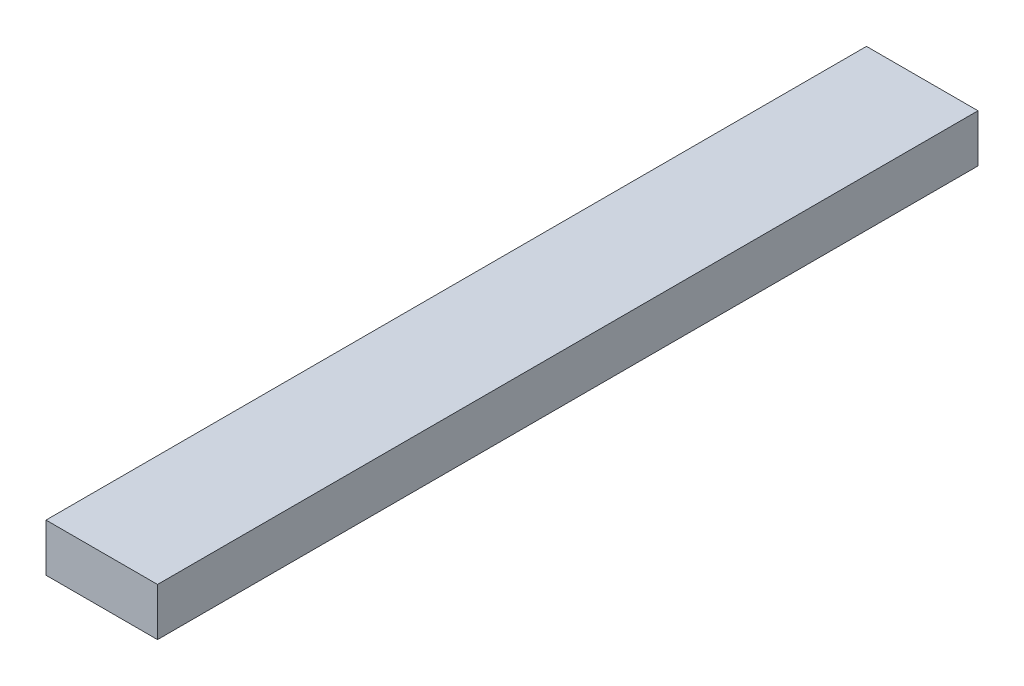
ISO-10303-21;
HEADER;
FILE_DESCRIPTION(('STEP AP214'),'2;1');
FILE_NAME('part.step','',(''),(''),'','','');
FILE_SCHEMA(('AUTOMOTIVE_DESIGN { 1 0 10303 214 1 1 1 1 }'));
ENDSEC;
DATA;
#1=APPLICATION_CONTEXT('core data for automotive mechanical design processes');
#2=APPLICATION_PROTOCOL_DEFINITION('international standard','automotive_design',2000,#1);
#3=PRODUCT_CONTEXT('',#1,'mechanical');
#4=PRODUCT('Part','Part','',(#3));
#5=PRODUCT_RELATED_PRODUCT_CATEGORY('part','',(#4));
#6=PRODUCT_DEFINITION_FORMATION('','',#4);
#7=PRODUCT_DEFINITION_CONTEXT('part definition',#1,'design');
#8=PRODUCT_DEFINITION('design','',#6,#7);
#9=PRODUCT_DEFINITION_SHAPE('','',#8);
#10=(LENGTH_UNIT() NAMED_UNIT(*) SI_UNIT(.MILLI.,.METRE.));
#11=(NAMED_UNIT(*) PLANE_ANGLE_UNIT() SI_UNIT($,.RADIAN.));
#12=(NAMED_UNIT(*) SI_UNIT($,.STERADIAN.) SOLID_ANGLE_UNIT());
#13=UNCERTAINTY_MEASURE_WITH_UNIT(LENGTH_MEASURE(1.E-05),#10,'distance_accuracy_value','');
#14=(GEOMETRIC_REPRESENTATION_CONTEXT(3) GLOBAL_UNCERTAINTY_ASSIGNED_CONTEXT((#13)) GLOBAL_UNIT_ASSIGNED_CONTEXT((#10,
#11,#12)) REPRESENTATION_CONTEXT('',''));
#15=CARTESIAN_POINT('',(0.,0.,0.));
#16=DIRECTION('',(0.,0.,1.));
#17=DIRECTION('',(1.,0.,0.));
#18=AXIS2_PLACEMENT_3D('',#15,#16,#17);
#19=CARTESIAN_POINT('',(-73.168223126647,74.6988449304645,654.05));
#20=DIRECTION('',(1.,0.,0.));
#21=DIRECTION('',(0.,0.,-1.));
#22=AXIS2_PLACEMENT_3D('',#19,#20,#21);
#23=PLANE('',#22);
#24=DIRECTION('',(0.,-1.,0.));
#25=VECTOR('',#24,1.);
#26=CARTESIAN_POINT('',(-73.168223126647,74.6988449304645,0.));
#27=LINE('',#26,#25);
#28=CARTESIAN_POINT('',(-73.168223126647,74.6988449304645,0.));
#29=VERTEX_POINT('',#28);
#30=CARTESIAN_POINT('',(-73.168223126647,36.5988449304645,0.));
#31=VERTEX_POINT('',#30);
#32=EDGE_CURVE('E95',#29,#31,#27,.T.);
#33=ORIENTED_EDGE('',*,*,#32,.T.);
#34=DIRECTION('',(0.,0.,-1.));
#35=VECTOR('',#34,1.);
#36=CARTESIAN_POINT('',(-73.168223126647,36.5988449304645,654.05));
#37=LINE('',#36,#35);
#38=CARTESIAN_POINT('',(-73.168223126647,36.5988449304645,654.05));
#39=VERTEX_POINT('',#38);
#40=EDGE_CURVE('E11',#39,#31,#37,.T.);
#41=ORIENTED_EDGE('',*,*,#40,.F.);
#42=DIRECTION('',(0.,-1.,0.));
#43=VECTOR('',#42,1.);
#44=CARTESIAN_POINT('',(-73.168223126647,74.6988449304645,654.05));
#45=LINE('',#44,#43);
#46=CARTESIAN_POINT('',(-73.168223126647,74.6988449304645,654.05));
#47=VERTEX_POINT('',#46);
#48=EDGE_CURVE('E83',#47,#39,#45,.T.);
#49=ORIENTED_EDGE('',*,*,#48,.F.);
#50=DIRECTION('',(0.,0.,-1.));
#51=VECTOR('',#50,1.);
#52=CARTESIAN_POINT('',(-73.168223126647,74.6988449304645,654.05));
#53=LINE('',#52,#51);
#54=EDGE_CURVE('E91',#47,#29,#53,.T.);
#55=ORIENTED_EDGE('',*,*,#54,.T.);
#56=EDGE_LOOP('',(#33,#41,#49,#55));
#57=FACE_BOUND('',#56,.T.);
#58=ADVANCED_FACE('F32',(#57),#23,.F.);
#59=CARTESIAN_POINT('',(-73.168223126647,36.5988449304645,654.05));
#60=DIRECTION('',(0.,1.,0.));
#61=DIRECTION('',(0.,0.,1.));
#62=AXIS2_PLACEMENT_3D('',#59,#60,#61);
#63=PLANE('',#62);
#64=DIRECTION('',(1.,0.,0.));
#65=VECTOR('',#64,1.);
#66=CARTESIAN_POINT('',(-73.168223126647,36.5988449304645,0.));
#67=LINE('',#66,#65);
#68=CARTESIAN_POINT('',(15.731776873353,36.5988449304645,0.));
#69=VERTEX_POINT('',#68);
#70=EDGE_CURVE('E87',#31,#69,#67,.T.);
#71=ORIENTED_EDGE('',*,*,#70,.T.);
#72=DIRECTION('',(0.,0.,-1.));
#73=VECTOR('',#72,1.);
#74=CARTESIAN_POINT('',(15.731776873353,36.5988449304645,654.05));
#75=LINE('',#74,#73);
#76=CARTESIAN_POINT('',(15.731776873353,36.5988449304645,654.05));
#77=VERTEX_POINT('',#76);
#78=EDGE_CURVE('E40',#77,#69,#75,.T.);
#79=ORIENTED_EDGE('',*,*,#78,.F.);
#80=DIRECTION('',(1.,0.,0.));
#81=VECTOR('',#80,1.);
#82=CARTESIAN_POINT('',(-73.168223126647,36.5988449304645,654.05));
#83=LINE('',#82,#81);
#84=EDGE_CURVE('E78',#39,#77,#83,.T.);
#85=ORIENTED_EDGE('',*,*,#84,.F.);
#86=ORIENTED_EDGE('',*,*,#40,.T.);
#87=EDGE_LOOP('',(#71,#79,#85,#86));
#88=FACE_BOUND('',#87,.T.);
#89=ADVANCED_FACE('F86',(#88),#63,.F.);
#90=CARTESIAN_POINT('',(15.731776873353,74.6988449304645,654.05));
#91=DIRECTION('',(-1.,0.,0.));
#92=DIRECTION('',(0.,-1.,0.));
#93=AXIS2_PLACEMENT_3D('',#90,#91,#92);
#94=PLANE('',#93);
#95=DIRECTION('',(0.,1.,0.));
#96=VECTOR('',#95,1.);
#97=CARTESIAN_POINT('',(15.731776873353,74.6988449304645,0.));
#98=LINE('',#97,#96);
#99=CARTESIAN_POINT('',(15.731776873353,74.6988449304645,0.));
#100=VERTEX_POINT('',#99);
#101=EDGE_CURVE('E65',#69,#100,#98,.T.);
#102=ORIENTED_EDGE('',*,*,#101,.T.);
#103=DIRECTION('',(0.,0.,-1.));
#104=VECTOR('',#103,1.);
#105=CARTESIAN_POINT('',(15.731776873353,74.6988449304645,654.05));
#106=LINE('',#105,#104);
#107=CARTESIAN_POINT('',(15.731776873353,74.6988449304645,654.05));
#108=VERTEX_POINT('',#107);
#109=EDGE_CURVE('E88',#108,#100,#106,.T.);
#110=ORIENTED_EDGE('',*,*,#109,.F.);
#111=DIRECTION('',(0.,1.,0.));
#112=VECTOR('',#111,1.);
#113=CARTESIAN_POINT('',(15.731776873353,74.6988449304645,654.05));
#114=LINE('',#113,#112);
#115=EDGE_CURVE('E81',#77,#108,#114,.T.);
#116=ORIENTED_EDGE('',*,*,#115,.F.);
#117=ORIENTED_EDGE('',*,*,#78,.T.);
#118=EDGE_LOOP('',(#102,#110,#116,#117));
#119=FACE_BOUND('',#118,.T.);
#120=ADVANCED_FACE('F89',(#119),#94,.F.);
#121=CARTESIAN_POINT('',(-73.168223126647,74.6988449304645,654.05));
#122=DIRECTION('',(0.,-1.,0.));
#123=DIRECTION('',(0.,0.,-1.));
#124=AXIS2_PLACEMENT_3D('',#121,#122,#123);
#125=PLANE('',#124);
#126=DIRECTION('',(-1.,0.,0.));
#127=VECTOR('',#126,1.);
#128=CARTESIAN_POINT('',(-73.168223126647,74.6988449304645,0.));
#129=LINE('',#128,#127);
#130=EDGE_CURVE('E71',#100,#29,#129,.T.);
#131=ORIENTED_EDGE('',*,*,#130,.T.);
#132=ORIENTED_EDGE('',*,*,#54,.F.);
#133=DIRECTION('',(-1.,0.,0.));
#134=VECTOR('',#133,1.);
#135=CARTESIAN_POINT('',(-73.168223126647,74.6988449304645,654.05));
#136=LINE('',#135,#134);
#137=EDGE_CURVE('E48',#108,#47,#136,.T.);
#138=ORIENTED_EDGE('',*,*,#137,.F.);
#139=ORIENTED_EDGE('',*,*,#109,.T.);
#140=EDGE_LOOP('',(#131,#132,#138,#139));
#141=FACE_BOUND('',#140,.T.);
#142=ADVANCED_FACE('F102',(#141),#125,.F.);
#143=CARTESIAN_POINT('',(0.,0.,654.05));
#144=DIRECTION('',(0.,0.,1.));
#145=DIRECTION('',(1.,0.,0.));
#146=AXIS2_PLACEMENT_3D('',#143,#144,#145);
#147=PLANE('',#146);
#148=ORIENTED_EDGE('',*,*,#48,.T.);
#149=ORIENTED_EDGE('',*,*,#84,.T.);
#150=ORIENTED_EDGE('',*,*,#115,.T.);
#151=ORIENTED_EDGE('',*,*,#137,.T.);
#152=EDGE_LOOP('',(#148,#149,#150,#151));
#153=FACE_BOUND('',#152,.T.);
#154=ADVANCED_FACE('F79',(#153),#147,.T.);
#155=CARTESIAN_POINT('',(0.,0.,0.));
#156=DIRECTION('',(0.,0.,1.));
#157=DIRECTION('',(1.,0.,0.));
#158=AXIS2_PLACEMENT_3D('',#155,#156,#157);
#159=PLANE('',#158);
#160=ORIENTED_EDGE('',*,*,#32,.F.);
#161=ORIENTED_EDGE('',*,*,#130,.F.);
#162=ORIENTED_EDGE('',*,*,#101,.F.);
#163=ORIENTED_EDGE('',*,*,#70,.F.);
#164=EDGE_LOOP('',(#160,#161,#162,#163));
#165=FACE_BOUND('',#164,.T.);
#166=ADVANCED_FACE('F105',(#165),#159,.F.);
#167=CLOSED_SHELL('',(#58,#89,#120,#142,#154,#166));
#168=MANIFOLD_SOLID_BREP('B2',#167);
#169=ADVANCED_BREP_SHAPE_REPRESENTATION('',(#18,#168),#14);
#170=SHAPE_DEFINITION_REPRESENTATION(#9,#169);
ENDSEC;
END-ISO-10303-21;
